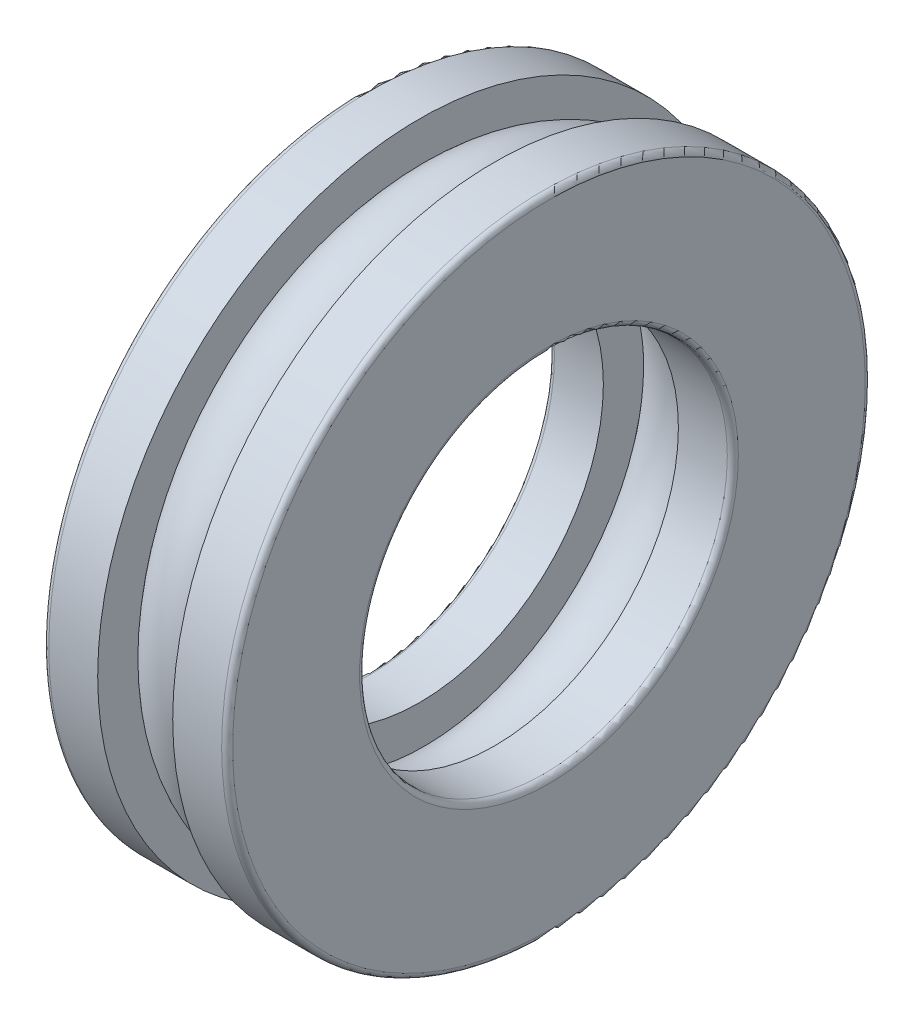
ISO-10303-21;
HEADER;
FILE_DESCRIPTION(('STEP AP214'),'2;1');
FILE_NAME('part.step','',(''),(''),'','','');
FILE_SCHEMA(('AUTOMOTIVE_DESIGN { 1 0 10303 214 1 1 1 1 }'));
ENDSEC;
DATA;
#1=APPLICATION_CONTEXT('core data for automotive mechanical design processes');
#2=APPLICATION_PROTOCOL_DEFINITION('international standard','automotive_design',2000,#1);
#3=PRODUCT_CONTEXT('',#1,'mechanical');
#4=PRODUCT('Part','Part','',(#3));
#5=PRODUCT_RELATED_PRODUCT_CATEGORY('part','',(#4));
#6=PRODUCT_DEFINITION_FORMATION('','',#4);
#7=PRODUCT_DEFINITION_CONTEXT('part definition',#1,'design');
#8=PRODUCT_DEFINITION('design','',#6,#7);
#9=PRODUCT_DEFINITION_SHAPE('','',#8);
#10=(LENGTH_UNIT() NAMED_UNIT(*) SI_UNIT(.MILLI.,.METRE.));
#11=(NAMED_UNIT(*) PLANE_ANGLE_UNIT() SI_UNIT($,.RADIAN.));
#12=(NAMED_UNIT(*) SI_UNIT($,.STERADIAN.) SOLID_ANGLE_UNIT());
#13=UNCERTAINTY_MEASURE_WITH_UNIT(LENGTH_MEASURE(1.E-05),#10,'distance_accuracy_value','');
#14=(GEOMETRIC_REPRESENTATION_CONTEXT(3) GLOBAL_UNCERTAINTY_ASSIGNED_CONTEXT((#13)) GLOBAL_UNIT_ASSIGNED_CONTEXT((#10,
#11,#12)) REPRESENTATION_CONTEXT('',''));
#15=CARTESIAN_POINT('',(0.,0.,0.));
#16=DIRECTION('',(0.,0.,1.));
#17=DIRECTION('',(1.,0.,0.));
#18=AXIS2_PLACEMENT_3D('',#15,#16,#17);
#19=CARTESIAN_POINT('',(0.,0.,0.));
#20=DIRECTION('',(-1.,0.,0.));
#21=DIRECTION('',(0.,0.,1.));
#22=AXIS2_PLACEMENT_3D('',#19,#20,#21);
#23=TOROIDAL_SURFACE('',#22,13.75,2.55);
#24=CARTESIAN_POINT('',(2.04,0.,0.));
#25=DIRECTION('',(-1.,0.,0.));
#26=DIRECTION('',(0.,0.,1.));
#27=AXIS2_PLACEMENT_3D('',#24,#25,#26);
#28=CIRCLE('',#27,15.28);
#29=CARTESIAN_POINT('',(2.04,0.,15.28));
#30=VERTEX_POINT('',#29);
#31=EDGE_CURVE('E35',#30,#30,#28,.T.);
#32=ORIENTED_EDGE('',*,*,#31,.T.);
#33=EDGE_LOOP('',(#32));
#34=FACE_BOUND('',#33,.T.);
#35=CARTESIAN_POINT('',(-2.04,0.,0.));
#36=DIRECTION('',(1.,0.,0.));
#37=DIRECTION('',(0.,0.,-1.));
#38=AXIS2_PLACEMENT_3D('',#35,#36,#37);
#39=CIRCLE('',#38,15.28);
#40=CARTESIAN_POINT('',(-2.04,0.,-15.28));
#41=VERTEX_POINT('',#40);
#42=EDGE_CURVE('E50',#41,#41,#39,.F.);
#43=ORIENTED_EDGE('',*,*,#42,.F.);
#44=EDGE_LOOP('',(#43));
#45=FACE_BOUND('',#44,.T.);
#46=ADVANCED_FACE('F31',(#34,#45),#23,.T.);
#47=CARTESIAN_POINT('',(-2.04,12.2620399870964,0.));
#48=DIRECTION('',(1.,0.,0.));
#49=DIRECTION('',(0.,0.,-1.));
#50=AXIS2_PLACEMENT_3D('',#47,#48,#49);
#51=PLANE('',#50);
#52=CARTESIAN_POINT('',(-2.04,0.,0.));
#53=DIRECTION('',(1.,0.,0.));
#54=DIRECTION('',(0.,0.,-1.));
#55=AXIS2_PLACEMENT_3D('',#52,#53,#54);
#56=CIRCLE('',#55,10.);
#57=CARTESIAN_POINT('',(-2.04,0.,-10.));
#58=VERTEX_POINT('',#57);
#59=EDGE_CURVE('E69',#58,#58,#56,.T.);
#60=ORIENTED_EDGE('',*,*,#59,.F.);
#61=EDGE_LOOP('',(#60));
#62=FACE_BOUND('',#61,.T.);
#63=CARTESIAN_POINT('',(-2.04,0.,0.));
#64=DIRECTION('',(-1.,0.,0.));
#65=DIRECTION('',(0.,0.,1.));
#66=AXIS2_PLACEMENT_3D('',#63,#64,#65);
#67=CIRCLE('',#66,12.22);
#68=CARTESIAN_POINT('',(-2.04,0.,12.22));
#69=VERTEX_POINT('',#68);
#70=EDGE_CURVE('E48',#69,#69,#67,.F.);
#71=ORIENTED_EDGE('',*,*,#70,.T.);
#72=EDGE_LOOP('',(#71));
#73=FACE_BOUND('',#72,.T.);
#74=ADVANCED_FACE('F98',(#62,#73),#51,.T.);
#75=CARTESIAN_POINT('',(-2.04,17.5,0.));
#76=DIRECTION('',(1.,0.,0.));
#77=DIRECTION('',(0.,0.,-1.));
#78=AXIS2_PLACEMENT_3D('',#75,#76,#77);
#79=PLANE('',#78);
#80=ORIENTED_EDGE('',*,*,#42,.T.);
#81=EDGE_LOOP('',(#80));
#82=FACE_BOUND('',#81,.T.);
#83=CARTESIAN_POINT('',(-2.04,0.,0.));
#84=DIRECTION('',(1.,0.,0.));
#85=DIRECTION('',(0.,0.,-1.));
#86=AXIS2_PLACEMENT_3D('',#83,#84,#85);
#87=CIRCLE('',#86,17.5);
#88=CARTESIAN_POINT('',(-2.04,0.,-17.5));
#89=VERTEX_POINT('',#88);
#90=EDGE_CURVE('E10',#89,#89,#87,.T.);
#91=ORIENTED_EDGE('',*,*,#90,.T.);
#92=EDGE_LOOP('',(#91));
#93=FACE_BOUND('',#92,.T.);
#94=ADVANCED_FACE('F33',(#82,#93),#79,.T.);
#95=CARTESIAN_POINT('',(-34.925,0.,0.));
#96=DIRECTION('',(1.,0.,0.));
#97=DIRECTION('',(0.,0.,-1.));
#98=AXIS2_PLACEMENT_3D('',#95,#96,#97);
#99=CYLINDRICAL_SURFACE('',#98,17.5);
#100=CARTESIAN_POINT('',(-4.7,0.,0.));
#101=DIRECTION('',(1.,0.,0.));
#102=DIRECTION('',(0.,0.,-1.));
#103=AXIS2_PLACEMENT_3D('',#100,#101,#102);
#104=CIRCLE('',#103,17.5);
#105=CARTESIAN_POINT('',(-4.7,0.,-17.5));
#106=VERTEX_POINT('',#105);
#107=EDGE_CURVE('E39',#106,#106,#104,.T.);
#108=ORIENTED_EDGE('',*,*,#107,.T.);
#109=EDGE_LOOP('',(#108));
#110=FACE_BOUND('',#109,.T.);
#111=ORIENTED_EDGE('',*,*,#90,.F.);
#112=EDGE_LOOP('',(#111));
#113=FACE_BOUND('',#112,.T.);
#114=ADVANCED_FACE('F95',(#110,#113),#99,.T.);
#115=CARTESIAN_POINT('',(-4.7,0.,0.));
#116=DIRECTION('',(1.,0.,0.));
#117=DIRECTION('',(0.,0.,-1.));
#118=AXIS2_PLACEMENT_3D('',#115,#116,#117);
#119=TOROIDAL_SURFACE('',#118,17.2,0.300000000000001);
#120=CARTESIAN_POINT('',(-5.,0.,0.));
#121=DIRECTION('',(1.,0.,0.));
#122=DIRECTION('',(0.,0.,-1.));
#123=AXIS2_PLACEMENT_3D('',#120,#121,#122);
#124=CIRCLE('',#123,17.2);
#125=CARTESIAN_POINT('',(-5.,0.,-17.2));
#126=VERTEX_POINT('',#125);
#127=EDGE_CURVE('E44',#126,#126,#124,.T.);
#128=ORIENTED_EDGE('',*,*,#127,.T.);
#129=EDGE_LOOP('',(#128));
#130=FACE_BOUND('',#129,.T.);
#131=ORIENTED_EDGE('',*,*,#107,.F.);
#132=EDGE_LOOP('',(#131));
#133=FACE_BOUND('',#132,.T.);
#134=ADVANCED_FACE('F80',(#130,#133),#119,.T.);
#135=CARTESIAN_POINT('',(-5.,10.3,0.));
#136=DIRECTION('',(-1.,0.,0.));
#137=DIRECTION('',(0.,0.,1.));
#138=AXIS2_PLACEMENT_3D('',#135,#136,#137);
#139=PLANE('',#138);
#140=CARTESIAN_POINT('',(-5.,0.,0.));
#141=DIRECTION('',(1.,0.,0.));
#142=DIRECTION('',(0.,0.,-1.));
#143=AXIS2_PLACEMENT_3D('',#140,#141,#142);
#144=CIRCLE('',#143,10.3);
#145=CARTESIAN_POINT('',(-5.,0.,-10.3));
#146=VERTEX_POINT('',#145);
#147=EDGE_CURVE('E75',#146,#146,#144,.T.);
#148=ORIENTED_EDGE('',*,*,#147,.T.);
#149=EDGE_LOOP('',(#148));
#150=FACE_BOUND('',#149,.T.);
#151=ORIENTED_EDGE('',*,*,#127,.F.);
#152=EDGE_LOOP('',(#151));
#153=FACE_BOUND('',#152,.T.);
#154=ADVANCED_FACE('F83',(#150,#153),#139,.T.);
#155=CARTESIAN_POINT('',(-4.7,0.,0.));
#156=DIRECTION('',(1.,0.,0.));
#157=DIRECTION('',(0.,0.,-1.));
#158=AXIS2_PLACEMENT_3D('',#155,#156,#157);
#159=TOROIDAL_SURFACE('',#158,10.3,0.300000000000001);
#160=CARTESIAN_POINT('',(-4.7,0.,0.));
#161=DIRECTION('',(1.,0.,0.));
#162=DIRECTION('',(0.,0.,-1.));
#163=AXIS2_PLACEMENT_3D('',#160,#161,#162);
#164=CIRCLE('',#163,10.);
#165=CARTESIAN_POINT('',(-4.7,0.,-10.));
#166=VERTEX_POINT('',#165);
#167=EDGE_CURVE('E72',#166,#166,#164,.T.);
#168=ORIENTED_EDGE('',*,*,#167,.T.);
#169=EDGE_LOOP('',(#168));
#170=FACE_BOUND('',#169,.T.);
#171=ORIENTED_EDGE('',*,*,#147,.F.);
#172=EDGE_LOOP('',(#171));
#173=FACE_BOUND('',#172,.T.);
#174=ADVANCED_FACE('F85',(#170,#173),#159,.T.);
#175=CARTESIAN_POINT('',(-34.925,0.,0.));
#176=DIRECTION('',(1.,0.,0.));
#177=DIRECTION('',(0.,0.,-1.));
#178=AXIS2_PLACEMENT_3D('',#175,#176,#177);
#179=CYLINDRICAL_SURFACE('',#178,10.);
#180=ORIENTED_EDGE('',*,*,#59,.T.);
#181=EDGE_LOOP('',(#180));
#182=FACE_BOUND('',#181,.T.);
#183=ORIENTED_EDGE('',*,*,#167,.F.);
#184=EDGE_LOOP('',(#183));
#185=FACE_BOUND('',#184,.T.);
#186=ADVANCED_FACE('F92',(#182,#185),#179,.F.);
#187=CARTESIAN_POINT('',(2.04,0.,0.));
#188=DIRECTION('',(1.,0.,0.));
#189=DIRECTION('',(0.,0.,-1.));
#190=AXIS2_PLACEMENT_3D('',#187,#188,#189);
#191=CIRCLE('',#190,12.22);
#192=CARTESIAN_POINT('',(2.04,0.,-12.22));
#193=VERTEX_POINT('',#192);
#194=EDGE_CURVE('E51',#193,#193,#191,.T.);
#195=ORIENTED_EDGE('',*,*,#194,.T.);
#196=EDGE_LOOP('',(#195));
#197=FACE_BOUND('',#196,.T.);
#198=ORIENTED_EDGE('',*,*,#70,.F.);
#199=EDGE_LOOP('',(#198));
#200=FACE_BOUND('',#199,.T.);
#201=ADVANCED_FACE('F101',(#197,#200),#23,.T.);
#202=CARTESIAN_POINT('',(2.04,12.2620399870964,0.));
#203=DIRECTION('',(-1.,0.,0.));
#204=DIRECTION('',(0.,0.,-1.));
#205=AXIS2_PLACEMENT_3D('',#202,#203,#204);
#206=PLANE('',#205);
#207=CARTESIAN_POINT('',(2.04,0.,0.));
#208=DIRECTION('',(1.,0.,0.));
#209=DIRECTION('',(0.,0.,-1.));
#210=AXIS2_PLACEMENT_3D('',#207,#208,#209);
#211=CIRCLE('',#210,10.);
#212=CARTESIAN_POINT('',(2.04,0.,-10.));
#213=VERTEX_POINT('',#212);
#214=EDGE_CURVE('E245',#213,#213,#211,.T.);
#215=ORIENTED_EDGE('',*,*,#214,.T.);
#216=EDGE_LOOP('',(#215));
#217=FACE_BOUND('',#216,.T.);
#218=ORIENTED_EDGE('',*,*,#194,.F.);
#219=EDGE_LOOP('',(#218));
#220=FACE_BOUND('',#219,.T.);
#221=ADVANCED_FACE('F110',(#217,#220),#206,.T.);
#222=CARTESIAN_POINT('',(2.04,17.5,0.));
#223=DIRECTION('',(-1.,0.,0.));
#224=DIRECTION('',(0.,0.,-1.));
#225=AXIS2_PLACEMENT_3D('',#222,#223,#224);
#226=PLANE('',#225);
#227=ORIENTED_EDGE('',*,*,#31,.F.);
#228=EDGE_LOOP('',(#227));
#229=FACE_BOUND('',#228,.T.);
#230=CARTESIAN_POINT('',(2.04,0.,0.));
#231=DIRECTION('',(1.,0.,0.));
#232=DIRECTION('',(0.,0.,-1.));
#233=AXIS2_PLACEMENT_3D('',#230,#231,#232);
#234=CIRCLE('',#233,17.5);
#235=CARTESIAN_POINT('',(2.04,0.,-17.5));
#236=VERTEX_POINT('',#235);
#237=EDGE_CURVE('E53',#236,#236,#234,.T.);
#238=ORIENTED_EDGE('',*,*,#237,.F.);
#239=EDGE_LOOP('',(#238));
#240=FACE_BOUND('',#239,.T.);
#241=ADVANCED_FACE('F115',(#229,#240),#226,.T.);
#242=CARTESIAN_POINT('',(34.925,0.,0.));
#243=DIRECTION('',(-1.,0.,0.));
#244=DIRECTION('',(0.,0.,-1.));
#245=AXIS2_PLACEMENT_3D('',#242,#243,#244);
#246=CYLINDRICAL_SURFACE('',#245,17.5);
#247=CARTESIAN_POINT('',(4.7,0.,0.));
#248=DIRECTION('',(1.,0.,0.));
#249=DIRECTION('',(0.,0.,-1.));
#250=AXIS2_PLACEMENT_3D('',#247,#248,#249);
#251=CIRCLE('',#250,17.5);
#252=CARTESIAN_POINT('',(4.7,0.,-17.5));
#253=VERTEX_POINT('',#252);
#254=EDGE_CURVE('E58',#253,#253,#251,.T.);
#255=ORIENTED_EDGE('',*,*,#254,.F.);
#256=EDGE_LOOP('',(#255));
#257=FACE_BOUND('',#256,.T.);
#258=ORIENTED_EDGE('',*,*,#237,.T.);
#259=EDGE_LOOP('',(#258));
#260=FACE_BOUND('',#259,.T.);
#261=ADVANCED_FACE('F189',(#257,#260),#246,.T.);
#262=CARTESIAN_POINT('',(4.7,0.,0.));
#263=DIRECTION('',(-1.,0.,0.));
#264=DIRECTION('',(0.,0.,-1.));
#265=AXIS2_PLACEMENT_3D('',#262,#263,#264);
#266=TOROIDAL_SURFACE('',#265,17.2,0.300000000000001);
#267=CARTESIAN_POINT('',(5.,0.,0.));
#268=DIRECTION('',(1.,0.,0.));
#269=DIRECTION('',(0.,0.,-1.));
#270=AXIS2_PLACEMENT_3D('',#267,#268,#269);
#271=CIRCLE('',#270,17.2);
#272=CARTESIAN_POINT('',(5.,0.,-17.2));
#273=VERTEX_POINT('',#272);
#274=EDGE_CURVE('E63',#273,#273,#271,.T.);
#275=ORIENTED_EDGE('',*,*,#274,.F.);
#276=EDGE_LOOP('',(#275));
#277=FACE_BOUND('',#276,.T.);
#278=ORIENTED_EDGE('',*,*,#254,.T.);
#279=EDGE_LOOP('',(#278));
#280=FACE_BOUND('',#279,.T.);
#281=ADVANCED_FACE('F197',(#277,#280),#266,.T.);
#282=CARTESIAN_POINT('',(5.,10.3,0.));
#283=DIRECTION('',(1.,0.,0.));
#284=DIRECTION('',(0.,0.,1.));
#285=AXIS2_PLACEMENT_3D('',#282,#283,#284);
#286=PLANE('',#285);
#287=CARTESIAN_POINT('',(5.,0.,0.));
#288=DIRECTION('',(1.,0.,0.));
#289=DIRECTION('',(0.,0.,-1.));
#290=AXIS2_PLACEMENT_3D('',#287,#288,#289);
#291=CIRCLE('',#290,10.3);
#292=CARTESIAN_POINT('',(5.,0.,-10.3));
#293=VERTEX_POINT('',#292);
#294=EDGE_CURVE('E249',#293,#293,#291,.T.);
#295=ORIENTED_EDGE('',*,*,#294,.F.);
#296=EDGE_LOOP('',(#295));
#297=FACE_BOUND('',#296,.T.);
#298=ORIENTED_EDGE('',*,*,#274,.T.);
#299=EDGE_LOOP('',(#298));
#300=FACE_BOUND('',#299,.T.);
#301=ADVANCED_FACE('F206',(#297,#300),#286,.T.);
#302=CARTESIAN_POINT('',(4.7,0.,0.));
#303=DIRECTION('',(-1.,0.,0.));
#304=DIRECTION('',(0.,0.,-1.));
#305=AXIS2_PLACEMENT_3D('',#302,#303,#304);
#306=TOROIDAL_SURFACE('',#305,10.3,0.300000000000001);
#307=CARTESIAN_POINT('',(4.7,0.,0.));
#308=DIRECTION('',(1.,0.,0.));
#309=DIRECTION('',(0.,0.,-1.));
#310=AXIS2_PLACEMENT_3D('',#307,#308,#309);
#311=CIRCLE('',#310,10.);
#312=CARTESIAN_POINT('',(4.7,0.,-10.));
#313=VERTEX_POINT('',#312);
#314=EDGE_CURVE('E248',#313,#313,#311,.T.);
#315=ORIENTED_EDGE('',*,*,#314,.F.);
#316=EDGE_LOOP('',(#315));
#317=FACE_BOUND('',#316,.T.);
#318=ORIENTED_EDGE('',*,*,#294,.T.);
#319=EDGE_LOOP('',(#318));
#320=FACE_BOUND('',#319,.T.);
#321=ADVANCED_FACE('F215',(#317,#320),#306,.T.);
#322=CARTESIAN_POINT('',(34.925,0.,0.));
#323=DIRECTION('',(-1.,0.,0.));
#324=DIRECTION('',(0.,0.,-1.));
#325=AXIS2_PLACEMENT_3D('',#322,#323,#324);
#326=CYLINDRICAL_SURFACE('',#325,10.);
#327=ORIENTED_EDGE('',*,*,#214,.F.);
#328=EDGE_LOOP('',(#327));
#329=FACE_BOUND('',#328,.T.);
#330=ORIENTED_EDGE('',*,*,#314,.T.);
#331=EDGE_LOOP('',(#330));
#332=FACE_BOUND('',#331,.T.);
#333=ADVANCED_FACE('F224',(#329,#332),#326,.F.);
#334=CLOSED_SHELL('',(#46,#74,#94,#114,#134,#154,#174,#186,#201,#221,#241,#261,#281,#301,#321,#333));
#335=MANIFOLD_SOLID_BREP('B2',#334);
#336=ADVANCED_BREP_SHAPE_REPRESENTATION('',(#18,#335),#14);
#337=SHAPE_DEFINITION_REPRESENTATION(#9,#336);
ENDSEC;
END-ISO-10303-21;
